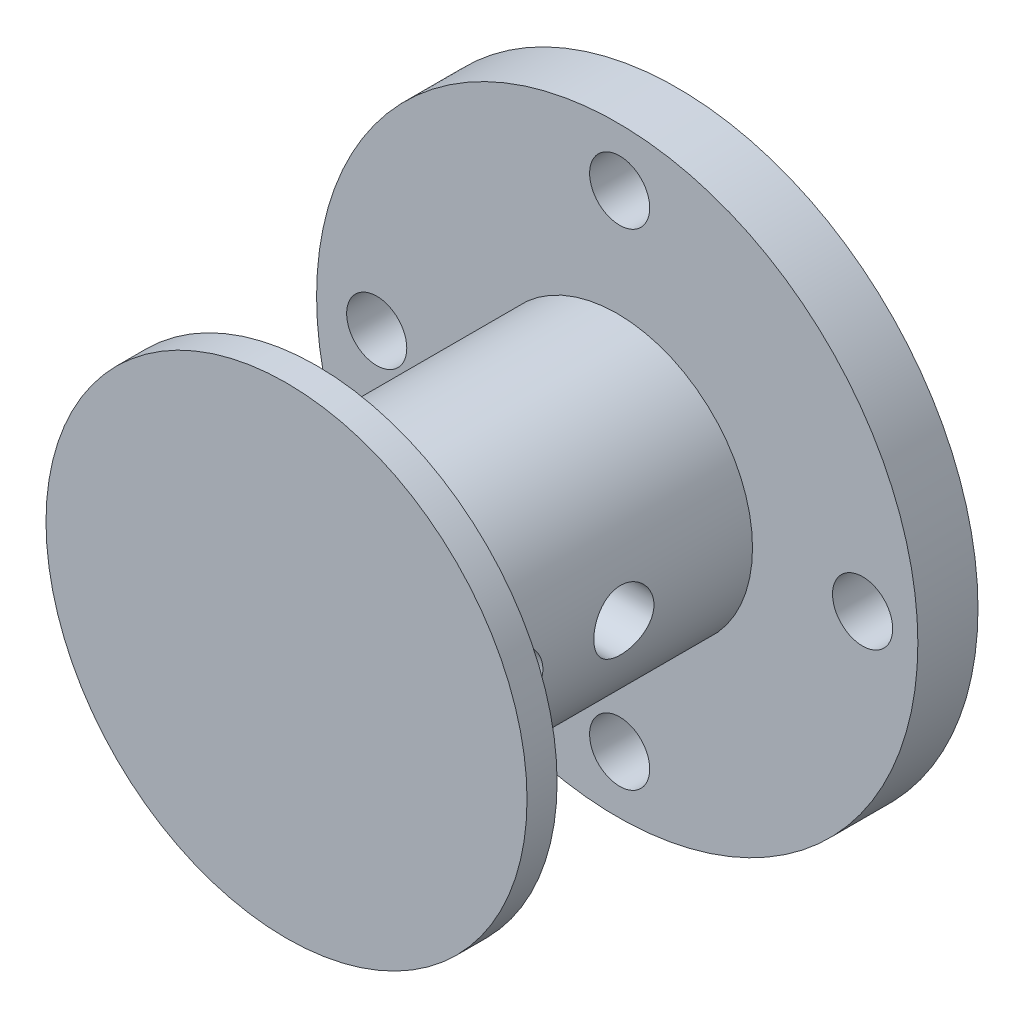
ISO-10303-21;
HEADER;
FILE_DESCRIPTION(('STEP AP214'),'2;1');
FILE_NAME('part.step','',(''),(''),'','','');
FILE_SCHEMA(('AUTOMOTIVE_DESIGN { 1 0 10303 214 1 1 1 1 }'));
ENDSEC;
DATA;
#1=APPLICATION_CONTEXT('core data for automotive mechanical design processes');
#2=APPLICATION_PROTOCOL_DEFINITION('international standard','automotive_design',2000,#1);
#3=PRODUCT_CONTEXT('',#1,'mechanical');
#4=PRODUCT('Part','Part','',(#3));
#5=PRODUCT_RELATED_PRODUCT_CATEGORY('part','',(#4));
#6=PRODUCT_DEFINITION_FORMATION('','',#4);
#7=PRODUCT_DEFINITION_CONTEXT('part definition',#1,'design');
#8=PRODUCT_DEFINITION('design','',#6,#7);
#9=PRODUCT_DEFINITION_SHAPE('','',#8);
#10=(LENGTH_UNIT() NAMED_UNIT(*) SI_UNIT(.MILLI.,.METRE.));
#11=(NAMED_UNIT(*) PLANE_ANGLE_UNIT() SI_UNIT($,.RADIAN.));
#12=(NAMED_UNIT(*) SI_UNIT($,.STERADIAN.) SOLID_ANGLE_UNIT());
#13=UNCERTAINTY_MEASURE_WITH_UNIT(LENGTH_MEASURE(1.E-05),#10,'distance_accuracy_value','');
#14=(GEOMETRIC_REPRESENTATION_CONTEXT(3) GLOBAL_UNCERTAINTY_ASSIGNED_CONTEXT((#13)) GLOBAL_UNIT_ASSIGNED_CONTEXT((#10,
#11,#12)) REPRESENTATION_CONTEXT('',''));
#15=CARTESIAN_POINT('',(0.,0.,0.));
#16=DIRECTION('',(0.,0.,1.));
#17=DIRECTION('',(1.,0.,0.));
#18=AXIS2_PLACEMENT_3D('',#15,#16,#17);
#19=CARTESIAN_POINT('',(0.,0.,12.));
#20=DIRECTION('',(0.,0.,-1.));
#21=DIRECTION('',(-1.,0.,0.));
#22=AXIS2_PLACEMENT_3D('',#19,#20,#21);
#23=CYLINDRICAL_SURFACE('',#22,4.5);
#24=CARTESIAN_POINT('',(0.,0.,12.));
#25=DIRECTION('',(0.,0.,1.));
#26=DIRECTION('',(1.,0.,0.));
#27=AXIS2_PLACEMENT_3D('',#24,#25,#26);
#28=CIRCLE('',#27,4.5);
#29=CARTESIAN_POINT('',(4.5,0.,12.));
#30=VERTEX_POINT('',#29);
#31=EDGE_CURVE('E116',#30,#30,#28,.T.);
#32=ORIENTED_EDGE('',*,*,#31,.F.);
#33=EDGE_LOOP('',(#32));
#34=FACE_BOUND('',#33,.T.);
#35=CARTESIAN_POINT('',(0.,0.,2.));
#36=DIRECTION('',(0.,0.,1.));
#37=DIRECTION('',(1.,0.,0.));
#38=AXIS2_PLACEMENT_3D('',#35,#36,#37);
#39=CIRCLE('',#38,4.5);
#40=CARTESIAN_POINT('',(4.5,0.,2.));
#41=VERTEX_POINT('',#40);
#42=EDGE_CURVE('E120',#41,#41,#39,.T.);
#43=ORIENTED_EDGE('',*,*,#42,.T.);
#44=EDGE_LOOP('',(#43));
#45=FACE_BOUND('',#44,.T.);
#46=CARTESIAN_POINT('',(4.5,0.,7.27837997559944));
#47=CARTESIAN_POINT('',(4.49999898109126,-0.0554402383878241,7.27837811375952));
#48=CARTESIAN_POINT('',(4.49896506997846,-0.11090278263481,7.27375398476769));
#49=CARTESIAN_POINT('',(4.49494048878835,-0.220250972051567,7.25539973942416));
#50=CARTESIAN_POINT('',(4.49194845108674,-0.274135487569494,7.24166325859479));
#51=CARTESIAN_POINT('',(4.48434056584504,-0.378731638880764,7.20553699035361));
#52=CARTESIAN_POINT('',(4.47972644219541,-0.429446576050142,7.1831563871005));
#53=CARTESIAN_POINT('',(4.46937167720689,-0.52640009015688,7.13040666936323));
#54=CARTESIAN_POINT('',(4.46363105773679,-0.572638753966673,7.10003770995413));
#55=CARTESIAN_POINT('',(4.45154547087105,-0.660093157007017,7.0316421430461));
#56=CARTESIAN_POINT('',(4.44519280820714,-0.701224306021767,6.99350872453186));
#57=CARTESIAN_POINT('',(4.43265300539893,-0.776562455229185,6.91089594555286));
#58=CARTESIAN_POINT('',(4.42646588044024,-0.810768822054276,6.86641600524421));
#59=CARTESIAN_POINT('',(4.41488164130856,-0.871662217051752,6.77174405357029));
#60=CARTESIAN_POINT('',(4.40949437871491,-0.898258710522017,6.72149249657867));
#61=CARTESIAN_POINT('',(4.40023048176198,-0.94259649477254,6.61709359475322));
#62=CARTESIAN_POINT('',(4.39635366052386,-0.96033888110048,6.56294673284731));
#63=CARTESIAN_POINT('',(4.39062804729594,-0.986184290032021,6.4532132369381));
#64=CARTESIAN_POINT('',(4.38874772903892,-0.994437335190343,6.39766361804672));
#65=CARTESIAN_POINT('',(4.38713336865335,-1.00153635498836,6.28593886670633));
#66=CARTESIAN_POINT('',(4.38739905389469,-1.00038352455831,6.22976381461836));
#67=CARTESIAN_POINT('',(4.39001816074073,-0.988824137586509,6.11950166200253));
#68=CARTESIAN_POINT('',(4.3923321569242,-0.978592322301085,6.06539516352976));
#69=CARTESIAN_POINT('',(4.39872477095838,-0.94944245340573,5.95968640393693));
#70=CARTESIAN_POINT('',(4.40280349066588,-0.930523898408257,5.90808428755674));
#71=CARTESIAN_POINT('',(4.41230454985148,-0.884378364364373,5.80836025640849));
#72=CARTESIAN_POINT('',(4.41773762181245,-0.857084596896763,5.7602703119314));
#73=CARTESIAN_POINT('',(4.42932868955372,-0.795010340699248,5.66928854034149));
#74=CARTESIAN_POINT('',(4.43548678710298,-0.760228800371371,5.62639744468936));
#75=CARTESIAN_POINT('',(4.44800287306333,-0.683243418514913,5.5460253209252));
#76=CARTESIAN_POINT('',(4.45436225343936,-0.640891102633116,5.50868658304691));
#77=CARTESIAN_POINT('',(4.46643919561158,-0.55045330904581,5.44161811114588));
#78=CARTESIAN_POINT('',(4.47215674504213,-0.502367720918685,5.41188852370849));
#79=CARTESIAN_POINT('',(4.48232532116804,-0.401651595367367,5.36084533771103));
#80=CARTESIAN_POINT('',(4.4867734650383,-0.349011061159927,5.33955085344531));
#81=CARTESIAN_POINT('',(4.49388068183127,-0.240777965490728,5.3061494690705));
#82=CARTESIAN_POINT('',(4.49654002348392,-0.185185848796682,5.29404118889237));
#83=CARTESIAN_POINT('',(4.49973158880836,-0.0738477416404218,5.27956396897185));
#84=CARTESIAN_POINT('',(4.50030624311145,-0.018128198659452,5.27700072551859));
#85=CARTESIAN_POINT('',(4.49938279325299,0.0929429619640402,5.28115902772962));
#86=CARTESIAN_POINT('',(4.4978848344523,0.148294605135323,5.28787992225916));
#87=CARTESIAN_POINT('',(4.49301129379307,0.256411628664711,5.31025468318349));
#88=CARTESIAN_POINT('',(4.4896572350388,0.309199245857742,5.32580620371116));
#89=CARTESIAN_POINT('',(4.48144710543397,0.411416402927916,5.36528681932197));
#90=CARTESIAN_POINT('',(4.4765909038233,0.460845650005089,5.38921664375244));
#91=CARTESIAN_POINT('',(4.4658107661382,0.555743219947189,5.44517641399893));
#92=CARTESIAN_POINT('',(4.45987222295123,0.601142865416123,5.47731994710252));
#93=CARTESIAN_POINT('',(4.4476151617454,0.68597348249406,5.54864560015015));
#94=CARTESIAN_POINT('',(4.44129659275087,0.725403650867063,5.58782866576549));
#95=CARTESIAN_POINT('',(4.42884439472905,0.797947740954927,5.67301399238979));
#96=CARTESIAN_POINT('',(4.42271658832142,0.830926909700366,5.71913202060273));
#97=CARTESIAN_POINT('',(4.41147697689154,0.88867305961376,5.81636599280484));
#98=CARTESIAN_POINT('',(4.40636512747635,0.913440399634868,5.86748171827048));
#99=CARTESIAN_POINT('',(4.39778600274463,0.953890009481296,5.972984120152));
#100=CARTESIAN_POINT('',(4.39430939829893,0.969623931773795,6.02735019673386));
#101=CARTESIAN_POINT('',(4.38937824848696,0.991710138292029,6.13804206803067));
#102=CARTESIAN_POINT('',(4.38792336773666,0.998063978591781,6.19436753611241));
#103=CARTESIAN_POINT('',(4.38722200724489,1.00114178320522,6.3060194147386));
#104=CARTESIAN_POINT('',(4.38792649185062,0.998079565719667,6.36133972962947));
#105=CARTESIAN_POINT('',(4.39135332478774,0.982891385608439,6.47065483058285));
#106=CARTESIAN_POINT('',(4.39407564773517,0.970765537001197,6.52464963331118));
#107=CARTESIAN_POINT('',(4.40120714065762,0.937899099903721,6.62960453571313));
#108=CARTESIAN_POINT('',(4.40561002591385,0.917190583142267,6.68057513404023));
#109=CARTESIAN_POINT('',(4.41560882234529,0.86777385174171,6.7783499718728));
#110=CARTESIAN_POINT('',(4.42120486238316,0.839064772925967,6.82515376058144));
#111=CARTESIAN_POINT('',(4.43310521417665,0.773756794952789,6.91431828007342));
#112=CARTESIAN_POINT('',(4.4394218568387,0.737005927555191,6.95656607806076));
#113=CARTESIAN_POINT('',(4.45196987086694,0.65696435297252,7.0343650125651));
#114=CARTESIAN_POINT('',(4.45820122214526,0.613672133116717,7.06991459585364));
#115=CARTESIAN_POINT('',(4.46997629863291,0.521072985322783,7.13376796705939));
#116=CARTESIAN_POINT('',(4.47550961749614,0.471692818317474,7.1619675754669));
#117=CARTESIAN_POINT('',(4.48516029184624,0.368780139889408,7.20962162769004));
#118=CARTESIAN_POINT('',(4.48927881635408,0.315251101656497,7.22908329562252));
#119=CARTESIAN_POINT('',(4.49491406454777,0.218069123864704,7.25530065073783));
#120=CARTESIAN_POINT('',(4.49680934511605,0.17493599595084,7.26393866243258));
#121=CARTESIAN_POINT('',(4.49935268729894,0.0878732249472634,7.27547892775251));
#122=CARTESIAN_POINT('',(4.50000080761806,0.0439436194464388,7.27838145135039));
#123=CARTESIAN_POINT('',(4.5,0.,7.27837997559944));
#124=B_SPLINE_CURVE_WITH_KNOTS('',3,(#46,#47,#48,#49,#50,#51,#52,#53,#54,#55,#56,#57,#58,#59,
#60,#61,#62,#63,#64,#65,#66,#67,#68,#69,#70,#71,#72,#73,#74,#75,#76,#77,#78,#79,#80,#81,#82,#83,
#84,#85,#86,#87,#88,#89,#90,#91,#92,#93,#94,#95,#96,#97,#98,#99,#100,#101,#102,#103,#104,#105,
#106,#107,#108,#109,#110,#111,#112,#113,#114,#115,#116,#117,#118,#119,#120,#121,#122,#123),
.UNSPECIFIED.,.T.,.F.,(4,2,2,2,2,2,2,2,2,2,2,2,2,2,2,2,2,2,2,2,2,2,2,2,2,2,2,2,2,2,2,2,2,2,2,2,
2,2,4),(0.,0.166159844864898,0.332435865624642,0.498535706203729,0.664632322584945,
0.833190360010395,1.00176380745257,1.17226648148988,1.3427480534387,1.51049562819053,
1.67822189248295,1.84278834072892,2.0073642887347,2.17328834854791,2.3392357262915,
2.50889089904488,2.67854933984914,2.84859006405619,3.01860523750994,3.18513996062134,
3.35166300456134,3.51629434712583,3.68094002472729,3.84799901631021,4.01508046693878,
4.18534736552864,4.35560682255205,4.52488279527622,4.69413068343205,4.85956392571208,
5.02499508691429,5.18981356007889,5.35464984293193,5.52292163156412,5.69123239233205,
5.86181293524784,6.03225218935467,6.16396173679278,6.29566508443975),.UNSPECIFIED.);
#125=CARTESIAN_POINT('',(4.5,0.,7.27837997559944));
#126=VERTEX_POINT('',#125);
#127=EDGE_CURVE('E65',#126,#126,#124,.T.);
#128=ORIENTED_EDGE('',*,*,#127,.F.);
#129=EDGE_LOOP('',(#128));
#130=FACE_BOUND('',#129,.T.);
#131=CARTESIAN_POINT('',(-4.5,0.,7.27837997559944));
#132=CARTESIAN_POINT('',(-4.49999898109126,0.0554402383878241,7.27837811375952));
#133=CARTESIAN_POINT('',(-4.49896506997846,0.11090278263481,7.27375398476769));
#134=CARTESIAN_POINT('',(-4.49494048878835,0.220250972051567,7.25539973942416));
#135=CARTESIAN_POINT('',(-4.49194845108674,0.274135487569494,7.24166325859479));
#136=CARTESIAN_POINT('',(-4.48434056584504,0.378731638880764,7.20553699035361));
#137=CARTESIAN_POINT('',(-4.47972644219541,0.429446576050142,7.1831563871005));
#138=CARTESIAN_POINT('',(-4.46937167720689,0.52640009015688,7.13040666936323));
#139=CARTESIAN_POINT('',(-4.46363105773679,0.572638753966673,7.10003770995413));
#140=CARTESIAN_POINT('',(-4.45154547087105,0.660093157007017,7.0316421430461));
#141=CARTESIAN_POINT('',(-4.44519280820714,0.701224306021767,6.99350872453186));
#142=CARTESIAN_POINT('',(-4.43265300539893,0.776562455229185,6.91089594555286));
#143=CARTESIAN_POINT('',(-4.42646588044024,0.810768822054276,6.86641600524421));
#144=CARTESIAN_POINT('',(-4.41488164130856,0.871662217051752,6.77174405357029));
#145=CARTESIAN_POINT('',(-4.40949437871491,0.898258710522017,6.72149249657867));
#146=CARTESIAN_POINT('',(-4.40023048176198,0.94259649477254,6.61709359475322));
#147=CARTESIAN_POINT('',(-4.39635366052386,0.96033888110048,6.56294673284731));
#148=CARTESIAN_POINT('',(-4.39062804729594,0.986184290032021,6.4532132369381));
#149=CARTESIAN_POINT('',(-4.38874772903892,0.994437335190343,6.39766361804672));
#150=CARTESIAN_POINT('',(-4.38713336865335,1.00153635498836,6.28593886670633));
#151=CARTESIAN_POINT('',(-4.38739905389469,1.00038352455831,6.22976381461836));
#152=CARTESIAN_POINT('',(-4.39001816074073,0.988824137586509,6.11950166200253));
#153=CARTESIAN_POINT('',(-4.3923321569242,0.978592322301085,6.06539516352976));
#154=CARTESIAN_POINT('',(-4.39872477095838,0.94944245340573,5.95968640393693));
#155=CARTESIAN_POINT('',(-4.40280349066588,0.930523898408257,5.90808428755674));
#156=CARTESIAN_POINT('',(-4.41230454985148,0.884378364364373,5.80836025640849));
#157=CARTESIAN_POINT('',(-4.41773762181245,0.857084596896763,5.7602703119314));
#158=CARTESIAN_POINT('',(-4.42932868955372,0.795010340699248,5.66928854034149));
#159=CARTESIAN_POINT('',(-4.43548678710298,0.760228800371371,5.62639744468936));
#160=CARTESIAN_POINT('',(-4.44800287306333,0.683243418514913,5.5460253209252));
#161=CARTESIAN_POINT('',(-4.45436225343936,0.640891102633116,5.50868658304691));
#162=CARTESIAN_POINT('',(-4.46643919561158,0.55045330904581,5.44161811114588));
#163=CARTESIAN_POINT('',(-4.47215674504213,0.502367720918685,5.41188852370849));
#164=CARTESIAN_POINT('',(-4.48232532116804,0.401651595367367,5.36084533771103));
#165=CARTESIAN_POINT('',(-4.4867734650383,0.349011061159927,5.33955085344531));
#166=CARTESIAN_POINT('',(-4.49388068183127,0.240777965490728,5.3061494690705));
#167=CARTESIAN_POINT('',(-4.49654002348392,0.185185848796682,5.29404118889237));
#168=CARTESIAN_POINT('',(-4.49973158880836,0.0738477416404218,5.27956396897185));
#169=CARTESIAN_POINT('',(-4.50030624311145,0.018128198659452,5.27700072551859));
#170=CARTESIAN_POINT('',(-4.49938279325299,-0.0929429619640402,5.28115902772962));
#171=CARTESIAN_POINT('',(-4.4978848344523,-0.148294605135323,5.28787992225916));
#172=CARTESIAN_POINT('',(-4.49301129379307,-0.256411628664711,5.31025468318349));
#173=CARTESIAN_POINT('',(-4.4896572350388,-0.309199245857742,5.32580620371116));
#174=CARTESIAN_POINT('',(-4.48144710543397,-0.411416402927916,5.36528681932197));
#175=CARTESIAN_POINT('',(-4.4765909038233,-0.460845650005089,5.38921664375244));
#176=CARTESIAN_POINT('',(-4.4658107661382,-0.555743219947189,5.44517641399893));
#177=CARTESIAN_POINT('',(-4.45987222295123,-0.601142865416123,5.47731994710252));
#178=CARTESIAN_POINT('',(-4.4476151617454,-0.68597348249406,5.54864560015015));
#179=CARTESIAN_POINT('',(-4.44129659275087,-0.725403650867063,5.58782866576549));
#180=CARTESIAN_POINT('',(-4.42884439472905,-0.797947740954927,5.67301399238979));
#181=CARTESIAN_POINT('',(-4.42271658832142,-0.830926909700366,5.71913202060273));
#182=CARTESIAN_POINT('',(-4.41147697689154,-0.88867305961376,5.81636599280484));
#183=CARTESIAN_POINT('',(-4.40636512747635,-0.913440399634868,5.86748171827048));
#184=CARTESIAN_POINT('',(-4.39778600274463,-0.953890009481296,5.972984120152));
#185=CARTESIAN_POINT('',(-4.39430939829893,-0.969623931773795,6.02735019673386));
#186=CARTESIAN_POINT('',(-4.38937824848696,-0.991710138292029,6.13804206803067));
#187=CARTESIAN_POINT('',(-4.38792336773666,-0.998063978591781,6.19436753611241));
#188=CARTESIAN_POINT('',(-4.38722200724489,-1.00114178320522,6.3060194147386));
#189=CARTESIAN_POINT('',(-4.38792649185062,-0.998079565719667,6.36133972962947));
#190=CARTESIAN_POINT('',(-4.39135332478774,-0.982891385608439,6.47065483058285));
#191=CARTESIAN_POINT('',(-4.39407564773517,-0.970765537001197,6.52464963331118));
#192=CARTESIAN_POINT('',(-4.40120714065762,-0.937899099903721,6.62960453571313));
#193=CARTESIAN_POINT('',(-4.40561002591385,-0.917190583142267,6.68057513404023));
#194=CARTESIAN_POINT('',(-4.41560882234529,-0.86777385174171,6.7783499718728));
#195=CARTESIAN_POINT('',(-4.42120486238316,-0.839064772925967,6.82515376058144));
#196=CARTESIAN_POINT('',(-4.43310521417665,-0.773756794952789,6.91431828007342));
#197=CARTESIAN_POINT('',(-4.4394218568387,-0.737005927555191,6.95656607806076));
#198=CARTESIAN_POINT('',(-4.45196987086694,-0.65696435297252,7.0343650125651));
#199=CARTESIAN_POINT('',(-4.45820122214526,-0.613672133116717,7.06991459585364));
#200=CARTESIAN_POINT('',(-4.46997629863291,-0.521072985322783,7.13376796705939));
#201=CARTESIAN_POINT('',(-4.47550961749614,-0.471692818317474,7.1619675754669));
#202=CARTESIAN_POINT('',(-4.48516029184624,-0.368780139889408,7.20962162769004));
#203=CARTESIAN_POINT('',(-4.48927881635408,-0.315251101656497,7.22908329562252));
#204=CARTESIAN_POINT('',(-4.49491406454777,-0.218069123864704,7.25530065073783));
#205=CARTESIAN_POINT('',(-4.49680934511605,-0.17493599595084,7.26393866243258));
#206=CARTESIAN_POINT('',(-4.49935268729894,-0.0878732249472634,7.27547892775251));
#207=CARTESIAN_POINT('',(-4.50000080761806,-0.0439436194464388,7.27838145135039));
#208=CARTESIAN_POINT('',(-4.5,0.,7.27837997559944));
#209=B_SPLINE_CURVE_WITH_KNOTS('',3,(#131,#132,#133,#134,#135,#136,#137,#138,#139,#140,#141,
#142,#143,#144,#145,#146,#147,#148,#149,#150,#151,#152,#153,#154,#155,#156,#157,#158,#159,#160,
#161,#162,#163,#164,#165,#166,#167,#168,#169,#170,#171,#172,#173,#174,#175,#176,#177,#178,#179,
#180,#181,#182,#183,#184,#185,#186,#187,#188,#189,#190,#191,#192,#193,#194,#195,#196,#197,#198,
#199,#200,#201,#202,#203,#204,#205,#206,#207,#208),.UNSPECIFIED.,.T.,.F.,(4,2,2,2,2,2,2,2,2,2,2,
2,2,2,2,2,2,2,2,2,2,2,2,2,2,2,2,2,2,2,2,2,2,2,2,2,2,2,4),(0.,0.166159844864898,
0.332435865624642,0.498535706203729,0.664632322584945,0.833190360010395,1.00176380745257,
1.17226648148988,1.3427480534387,1.51049562819053,1.67822189248295,1.84278834072892,
2.0073642887347,2.17328834854791,2.3392357262915,2.50889089904488,2.67854933984914,
2.84859006405619,3.01860523750994,3.18513996062134,3.35166300456134,3.51629434712583,
3.68094002472729,3.84799901631021,4.01508046693878,4.18534736552864,4.35560682255205,
4.52488279527622,4.69413068343205,4.85956392571208,5.02499508691429,5.18981356007889,
5.35464984293193,5.52292163156412,5.69123239233205,5.86181293524784,6.03225218935467,
6.16396173679278,6.29566508443975),.UNSPECIFIED.);
#210=CARTESIAN_POINT('',(-4.5,0.,7.27837997559944));
#211=VERTEX_POINT('',#210);
#212=EDGE_CURVE('E73',#211,#211,#209,.T.);
#213=ORIENTED_EDGE('',*,*,#212,.F.);
#214=EDGE_LOOP('',(#213));
#215=FACE_BOUND('',#214,.T.);
#216=CARTESIAN_POINT('',(4.5,0.,10.9724472509308));
#217=CARTESIAN_POINT('',(4.49999898109126,-0.0554402383878242,10.9724453890909));
#218=CARTESIAN_POINT('',(4.49896506997846,-0.11090278263481,10.9678212600991));
#219=CARTESIAN_POINT('',(4.49494048878835,-0.220250972051567,10.9494670147556));
#220=CARTESIAN_POINT('',(4.49194845108674,-0.274135487569494,10.9357305339262));
#221=CARTESIAN_POINT('',(4.48434056584504,-0.378731638880765,10.899604265685));
#222=CARTESIAN_POINT('',(4.47972644219541,-0.429446576050143,10.8772236624319));
#223=CARTESIAN_POINT('',(4.46937167720689,-0.526400090156881,10.8244739446946));
#224=CARTESIAN_POINT('',(4.46363105773679,-0.572638753966673,10.7941049852855));
#225=CARTESIAN_POINT('',(4.45154547087105,-0.660093157007017,10.7257094183775));
#226=CARTESIAN_POINT('',(4.44519280820714,-0.701224306021768,10.6875759998633));
#227=CARTESIAN_POINT('',(4.43265300539893,-0.776562455229186,10.6049632208843));
#228=CARTESIAN_POINT('',(4.42646588044024,-0.810768822054277,10.5604832805756));
#229=CARTESIAN_POINT('',(4.41488164130856,-0.871662217051754,10.4658113289017));
#230=CARTESIAN_POINT('',(4.40949437871491,-0.898258710522019,10.4155597719101));
#231=CARTESIAN_POINT('',(4.40023048176198,-0.942596494772542,10.3111608700846));
#232=CARTESIAN_POINT('',(4.39635366052386,-0.960338881100481,10.2570140081787));
#233=CARTESIAN_POINT('',(4.39062804729594,-0.986184290032023,10.1472805122695));
#234=CARTESIAN_POINT('',(4.38874772903891,-0.994437335190345,10.0917308933781));
#235=CARTESIAN_POINT('',(4.38713336865335,-1.00153635498837,9.98000614203773));
#236=CARTESIAN_POINT('',(4.38739905389469,-1.00038352455832,9.92383108994975));
#237=CARTESIAN_POINT('',(4.39001816074073,-0.98882413758651,9.81356893733392));
#238=CARTESIAN_POINT('',(4.3923321569242,-0.978592322301087,9.75946243886115));
#239=CARTESIAN_POINT('',(4.39872477095838,-0.949442453405732,9.65375367926833));
#240=CARTESIAN_POINT('',(4.40280349066588,-0.930523898408259,9.60215156288812));
#241=CARTESIAN_POINT('',(4.41230454985148,-0.884378364364374,9.50242753173988));
#242=CARTESIAN_POINT('',(4.41773762181245,-0.857084596896764,9.45433758726279));
#243=CARTESIAN_POINT('',(4.42932868955372,-0.795010340699249,9.36335581567288));
#244=CARTESIAN_POINT('',(4.43548678710298,-0.760228800371372,9.32046472002075));
#245=CARTESIAN_POINT('',(4.44800287306333,-0.683243418514914,9.24009259625659));
#246=CARTESIAN_POINT('',(4.45436225343936,-0.640891102633117,9.2027538583783));
#247=CARTESIAN_POINT('',(4.46643919561158,-0.55045330904581,9.13568538647727));
#248=CARTESIAN_POINT('',(4.47215674504213,-0.502367720918686,9.10595579903988));
#249=CARTESIAN_POINT('',(4.48232532116804,-0.401651595367368,9.05491261304242));
#250=CARTESIAN_POINT('',(4.4867734650383,-0.349011061159928,9.0336181287767));
#251=CARTESIAN_POINT('',(4.49388068183127,-0.240777965490729,9.00021674440189));
#252=CARTESIAN_POINT('',(4.49654002348392,-0.185185848796683,8.98810846422376));
#253=CARTESIAN_POINT('',(4.49973158880836,-0.0738477416404228,8.97363124430324));
#254=CARTESIAN_POINT('',(4.50030624311145,-0.0181281986594528,8.97106800084998));
#255=CARTESIAN_POINT('',(4.49938279325299,0.0929429619640398,8.97522630306101));
#256=CARTESIAN_POINT('',(4.4978848344523,0.148294605135323,8.98194719759055));
#257=CARTESIAN_POINT('',(4.49301129379307,0.256411628664711,9.00432195851488));
#258=CARTESIAN_POINT('',(4.4896572350388,0.309199245857742,9.01987347904255));
#259=CARTESIAN_POINT('',(4.48144710543397,0.411416402927916,9.05935409465336));
#260=CARTESIAN_POINT('',(4.4765909038233,0.460845650005089,9.08328391908383));
#261=CARTESIAN_POINT('',(4.4658107661382,0.55574321994719,9.13924368933032));
#262=CARTESIAN_POINT('',(4.45987222295124,0.601142865416123,9.17138722243391));
#263=CARTESIAN_POINT('',(4.4476151617454,0.68597348249406,9.24271287548154));
#264=CARTESIAN_POINT('',(4.44129659275087,0.725403650867063,9.28189594109687));
#265=CARTESIAN_POINT('',(4.42884439472905,0.797947740954928,9.36708126772117));
#266=CARTESIAN_POINT('',(4.42271658832142,0.830926909700367,9.41319929593413));
#267=CARTESIAN_POINT('',(4.41147697689154,0.888673059613761,9.51043326813623));
#268=CARTESIAN_POINT('',(4.40636512747635,0.913440399634869,9.56154899360187));
#269=CARTESIAN_POINT('',(4.39778600274463,0.953890009481297,9.66705139548339));
#270=CARTESIAN_POINT('',(4.39430939829893,0.969623931773796,9.72141747206524));
#271=CARTESIAN_POINT('',(4.38937824848696,0.99171013829203,9.83210934336206));
#272=CARTESIAN_POINT('',(4.38792336773666,0.998063978591782,9.8884348114438));
#273=CARTESIAN_POINT('',(4.38722200724489,1.00114178320522,10.00008669007));
#274=CARTESIAN_POINT('',(4.38792649185062,0.998079565719669,10.0554070049609));
#275=CARTESIAN_POINT('',(4.39135332478774,0.98289138560844,10.1647221059142));
#276=CARTESIAN_POINT('',(4.39407564773517,0.970765537001199,10.2187169086426));
#277=CARTESIAN_POINT('',(4.40120714065762,0.937899099903723,10.3236718110445));
#278=CARTESIAN_POINT('',(4.40561002591385,0.917190583142269,10.3746424093716));
#279=CARTESIAN_POINT('',(4.41560882234529,0.867773851741712,10.4724172472042));
#280=CARTESIAN_POINT('',(4.42120486238316,0.839064772925969,10.5192210359128));
#281=CARTESIAN_POINT('',(4.43310521417665,0.773756794952791,10.6083855554048));
#282=CARTESIAN_POINT('',(4.4394218568387,0.737005927555193,10.6506333533922));
#283=CARTESIAN_POINT('',(4.45196987086694,0.656964352972521,10.7284322878965));
#284=CARTESIAN_POINT('',(4.45820122214526,0.613672133116718,10.763981871185));
#285=CARTESIAN_POINT('',(4.46997629863291,0.521072985322783,10.8278352423908));
#286=CARTESIAN_POINT('',(4.47550961749614,0.471692818317475,10.8560348507983));
#287=CARTESIAN_POINT('',(4.48516029184624,0.368780139889409,10.9036889030214));
#288=CARTESIAN_POINT('',(4.48927881635408,0.315251101656498,10.9231505709539));
#289=CARTESIAN_POINT('',(4.49491406454777,0.218069123864705,10.9493679260692));
#290=CARTESIAN_POINT('',(4.49680934511605,0.174935995950841,10.958005937764));
#291=CARTESIAN_POINT('',(4.49935268729894,0.0878732249472641,10.9695462030839));
#292=CARTESIAN_POINT('',(4.50000080761806,0.0439436194464391,10.9724487266818));
#293=CARTESIAN_POINT('',(4.5,0.,10.9724472509308));
#294=B_SPLINE_CURVE_WITH_KNOTS('',3,(#216,#217,#218,#219,#220,#221,#222,#223,#224,#225,#226,
#227,#228,#229,#230,#231,#232,#233,#234,#235,#236,#237,#238,#239,#240,#241,#242,#243,#244,#245,
#246,#247,#248,#249,#250,#251,#252,#253,#254,#255,#256,#257,#258,#259,#260,#261,#262,#263,#264,
#265,#266,#267,#268,#269,#270,#271,#272,#273,#274,#275,#276,#277,#278,#279,#280,#281,#282,#283,
#284,#285,#286,#287,#288,#289,#290,#291,#292,#293),.UNSPECIFIED.,.T.,.F.,(4,2,2,2,2,2,2,2,2,2,2,
2,2,2,2,2,2,2,2,2,2,2,2,2,2,2,2,2,2,2,2,2,2,2,2,2,2,2,4),(0.,0.166159844864899,
0.332435865624642,0.49853570620373,0.664632322584946,0.833190360010395,1.00176380745257,
1.17226648148988,1.3427480534387,1.51049562819054,1.67822189248296,1.84278834072892,
2.0073642887347,2.17328834854791,2.3392357262915,2.50889089904489,2.67854933984914,
2.84859006405619,3.01860523750994,3.18513996062135,3.35166300456134,3.51629434712584,
3.6809400247273,3.84799901631021,4.01508046693879,4.18534736552865,4.35560682255206,
4.52488279527622,4.69413068343206,4.85956392571209,5.0249950869143,5.1898135600789,
5.35464984293194,5.52292163156413,5.69123239233206,5.86181293524785,6.03225218935468,
6.16396173679279,6.29566508443976),.UNSPECIFIED.);
#295=CARTESIAN_POINT('',(4.5,0.,10.9724472509308));
#296=VERTEX_POINT('',#295);
#297=EDGE_CURVE('E129',#296,#296,#294,.T.);
#298=ORIENTED_EDGE('',*,*,#297,.F.);
#299=EDGE_LOOP('',(#298));
#300=FACE_BOUND('',#299,.T.);
#301=CARTESIAN_POINT('',(-4.5,0.,10.9724472509308));
#302=CARTESIAN_POINT('',(-4.49999898109126,0.0554402383878242,10.9724453890909));
#303=CARTESIAN_POINT('',(-4.49896506997846,0.11090278263481,10.9678212600991));
#304=CARTESIAN_POINT('',(-4.49494048878835,0.220250972051567,10.9494670147556));
#305=CARTESIAN_POINT('',(-4.49194845108674,0.274135487569494,10.9357305339262));
#306=CARTESIAN_POINT('',(-4.48434056584504,0.378731638880765,10.899604265685));
#307=CARTESIAN_POINT('',(-4.47972644219541,0.429446576050143,10.8772236624319));
#308=CARTESIAN_POINT('',(-4.46937167720689,0.526400090156881,10.8244739446946));
#309=CARTESIAN_POINT('',(-4.46363105773679,0.572638753966673,10.7941049852855));
#310=CARTESIAN_POINT('',(-4.45154547087105,0.660093157007017,10.7257094183775));
#311=CARTESIAN_POINT('',(-4.44519280820714,0.701224306021768,10.6875759998633));
#312=CARTESIAN_POINT('',(-4.43265300539893,0.776562455229186,10.6049632208843));
#313=CARTESIAN_POINT('',(-4.42646588044024,0.810768822054277,10.5604832805756));
#314=CARTESIAN_POINT('',(-4.41488164130856,0.871662217051754,10.4658113289017));
#315=CARTESIAN_POINT('',(-4.40949437871491,0.898258710522019,10.4155597719101));
#316=CARTESIAN_POINT('',(-4.40023048176198,0.942596494772542,10.3111608700846));
#317=CARTESIAN_POINT('',(-4.39635366052386,0.960338881100481,10.2570140081787));
#318=CARTESIAN_POINT('',(-4.39062804729594,0.986184290032023,10.1472805122695));
#319=CARTESIAN_POINT('',(-4.38874772903891,0.994437335190345,10.0917308933781));
#320=CARTESIAN_POINT('',(-4.38713336865335,1.00153635498837,9.98000614203773));
#321=CARTESIAN_POINT('',(-4.38739905389469,1.00038352455832,9.92383108994975));
#322=CARTESIAN_POINT('',(-4.39001816074073,0.98882413758651,9.81356893733392));
#323=CARTESIAN_POINT('',(-4.3923321569242,0.978592322301087,9.75946243886115));
#324=CARTESIAN_POINT('',(-4.39872477095838,0.949442453405732,9.65375367926833));
#325=CARTESIAN_POINT('',(-4.40280349066588,0.930523898408259,9.60215156288812));
#326=CARTESIAN_POINT('',(-4.41230454985148,0.884378364364374,9.50242753173988));
#327=CARTESIAN_POINT('',(-4.41773762181245,0.857084596896764,9.45433758726279));
#328=CARTESIAN_POINT('',(-4.42932868955372,0.795010340699249,9.36335581567288));
#329=CARTESIAN_POINT('',(-4.43548678710298,0.760228800371372,9.32046472002075));
#330=CARTESIAN_POINT('',(-4.44800287306333,0.683243418514914,9.24009259625659));
#331=CARTESIAN_POINT('',(-4.45436225343936,0.640891102633117,9.2027538583783));
#332=CARTESIAN_POINT('',(-4.46643919561158,0.55045330904581,9.13568538647727));
#333=CARTESIAN_POINT('',(-4.47215674504213,0.502367720918686,9.10595579903988));
#334=CARTESIAN_POINT('',(-4.48232532116804,0.401651595367368,9.05491261304242));
#335=CARTESIAN_POINT('',(-4.4867734650383,0.349011061159928,9.0336181287767));
#336=CARTESIAN_POINT('',(-4.49388068183127,0.240777965490729,9.00021674440189));
#337=CARTESIAN_POINT('',(-4.49654002348392,0.185185848796683,8.98810846422376));
#338=CARTESIAN_POINT('',(-4.49973158880836,0.0738477416404228,8.97363124430324));
#339=CARTESIAN_POINT('',(-4.50030624311145,0.0181281986594528,8.97106800084998));
#340=CARTESIAN_POINT('',(-4.49938279325299,-0.0929429619640398,8.97522630306101));
#341=CARTESIAN_POINT('',(-4.4978848344523,-0.148294605135323,8.98194719759055));
#342=CARTESIAN_POINT('',(-4.49301129379307,-0.256411628664711,9.00432195851488));
#343=CARTESIAN_POINT('',(-4.4896572350388,-0.309199245857742,9.01987347904255));
#344=CARTESIAN_POINT('',(-4.48144710543397,-0.411416402927916,9.05935409465336));
#345=CARTESIAN_POINT('',(-4.4765909038233,-0.460845650005089,9.08328391908383));
#346=CARTESIAN_POINT('',(-4.4658107661382,-0.55574321994719,9.13924368933032));
#347=CARTESIAN_POINT('',(-4.45987222295124,-0.601142865416123,9.17138722243391));
#348=CARTESIAN_POINT('',(-4.4476151617454,-0.68597348249406,9.24271287548154));
#349=CARTESIAN_POINT('',(-4.44129659275087,-0.725403650867063,9.28189594109687));
#350=CARTESIAN_POINT('',(-4.42884439472905,-0.797947740954928,9.36708126772117));
#351=CARTESIAN_POINT('',(-4.42271658832142,-0.830926909700367,9.41319929593413));
#352=CARTESIAN_POINT('',(-4.41147697689154,-0.888673059613761,9.51043326813623));
#353=CARTESIAN_POINT('',(-4.40636512747635,-0.913440399634869,9.56154899360187));
#354=CARTESIAN_POINT('',(-4.39778600274463,-0.953890009481297,9.66705139548339));
#355=CARTESIAN_POINT('',(-4.39430939829893,-0.969623931773796,9.72141747206524));
#356=CARTESIAN_POINT('',(-4.38937824848696,-0.99171013829203,9.83210934336206));
#357=CARTESIAN_POINT('',(-4.38792336773666,-0.998063978591782,9.8884348114438));
#358=CARTESIAN_POINT('',(-4.38722200724489,-1.00114178320522,10.00008669007));
#359=CARTESIAN_POINT('',(-4.38792649185062,-0.998079565719669,10.0554070049609));
#360=CARTESIAN_POINT('',(-4.39135332478774,-0.98289138560844,10.1647221059142));
#361=CARTESIAN_POINT('',(-4.39407564773517,-0.970765537001199,10.2187169086426));
#362=CARTESIAN_POINT('',(-4.40120714065762,-0.937899099903723,10.3236718110445));
#363=CARTESIAN_POINT('',(-4.40561002591385,-0.917190583142269,10.3746424093716));
#364=CARTESIAN_POINT('',(-4.41560882234529,-0.867773851741712,10.4724172472042));
#365=CARTESIAN_POINT('',(-4.42120486238316,-0.839064772925969,10.5192210359128));
#366=CARTESIAN_POINT('',(-4.43310521417665,-0.773756794952791,10.6083855554048));
#367=CARTESIAN_POINT('',(-4.4394218568387,-0.737005927555193,10.6506333533922));
#368=CARTESIAN_POINT('',(-4.45196987086694,-0.656964352972521,10.7284322878965));
#369=CARTESIAN_POINT('',(-4.45820122214526,-0.613672133116718,10.763981871185));
#370=CARTESIAN_POINT('',(-4.46997629863291,-0.521072985322783,10.8278352423908));
#371=CARTESIAN_POINT('',(-4.47550961749614,-0.471692818317475,10.8560348507983));
#372=CARTESIAN_POINT('',(-4.48516029184624,-0.368780139889409,10.9036889030214));
#373=CARTESIAN_POINT('',(-4.48927881635408,-0.315251101656498,10.9231505709539));
#374=CARTESIAN_POINT('',(-4.49491406454777,-0.218069123864705,10.9493679260692));
#375=CARTESIAN_POINT('',(-4.49680934511605,-0.174935995950841,10.958005937764));
#376=CARTESIAN_POINT('',(-4.49935268729894,-0.0878732249472641,10.9695462030839));
#377=CARTESIAN_POINT('',(-4.50000080761806,-0.0439436194464391,10.9724487266818));
#378=CARTESIAN_POINT('',(-4.5,0.,10.9724472509308));
#379=B_SPLINE_CURVE_WITH_KNOTS('',3,(#301,#302,#303,#304,#305,#306,#307,#308,#309,#310,#311,
#312,#313,#314,#315,#316,#317,#318,#319,#320,#321,#322,#323,#324,#325,#326,#327,#328,#329,#330,
#331,#332,#333,#334,#335,#336,#337,#338,#339,#340,#341,#342,#343,#344,#345,#346,#347,#348,#349,
#350,#351,#352,#353,#354,#355,#356,#357,#358,#359,#360,#361,#362,#363,#364,#365,#366,#367,#368,
#369,#370,#371,#372,#373,#374,#375,#376,#377,#378),.UNSPECIFIED.,.T.,.F.,(4,2,2,2,2,2,2,2,2,2,2,
2,2,2,2,2,2,2,2,2,2,2,2,2,2,2,2,2,2,2,2,2,2,2,2,2,2,2,4),(0.,0.166159844864899,
0.332435865624642,0.49853570620373,0.664632322584946,0.833190360010395,1.00176380745257,
1.17226648148988,1.3427480534387,1.51049562819054,1.67822189248296,1.84278834072892,
2.0073642887347,2.17328834854791,2.3392357262915,2.50889089904489,2.67854933984914,
2.84859006405619,3.01860523750994,3.18513996062135,3.35166300456134,3.51629434712584,
3.6809400247273,3.84799901631021,4.01508046693879,4.18534736552865,4.35560682255206,
4.52488279527622,4.69413068343206,4.85956392571209,5.0249950869143,5.1898135600789,
5.35464984293194,5.52292163156413,5.69123239233206,5.86181293524785,6.03225218935468,
6.16396173679279,6.29566508443976),.UNSPECIFIED.);
#380=CARTESIAN_POINT('',(-4.5,0.,10.9724472509308));
#381=VERTEX_POINT('',#380);
#382=EDGE_CURVE('E43',#381,#381,#379,.T.);
#383=ORIENTED_EDGE('',*,*,#382,.F.);
#384=EDGE_LOOP('',(#383));
#385=FACE_BOUND('',#384,.T.);
#386=ADVANCED_FACE('F39',(#34,#45,#130,#215,#300,#385),#23,.T.);
#387=CARTESIAN_POINT('',(0.,0.,2.));
#388=DIRECTION('',(0.,0.,-1.));
#389=DIRECTION('',(-1.,0.,0.));
#390=AXIS2_PLACEMENT_3D('',#387,#388,#389);
#391=CYLINDRICAL_SURFACE('',#390,10.);
#392=CARTESIAN_POINT('',(0.,0.,2.));
#393=DIRECTION('',(0.,0.,1.));
#394=DIRECTION('',(1.,0.,0.));
#395=AXIS2_PLACEMENT_3D('',#392,#393,#394);
#396=CIRCLE('',#395,10.);
#397=CARTESIAN_POINT('',(10.,0.,2.));
#398=VERTEX_POINT('',#397);
#399=EDGE_CURVE('E10',#398,#398,#396,.T.);
#400=ORIENTED_EDGE('',*,*,#399,.F.);
#401=EDGE_LOOP('',(#400));
#402=FACE_BOUND('',#401,.T.);
#403=CARTESIAN_POINT('',(0.,0.,0.));
#404=DIRECTION('',(0.,0.,1.));
#405=DIRECTION('',(1.,0.,0.));
#406=AXIS2_PLACEMENT_3D('',#403,#404,#405);
#407=CIRCLE('',#406,10.);
#408=CARTESIAN_POINT('',(10.,0.,0.));
#409=VERTEX_POINT('',#408);
#410=EDGE_CURVE('E53',#409,#409,#407,.T.);
#411=ORIENTED_EDGE('',*,*,#410,.T.);
#412=EDGE_LOOP('',(#411));
#413=FACE_BOUND('',#412,.T.);
#414=ADVANCED_FACE('F41',(#402,#413),#391,.T.);
#415=CARTESIAN_POINT('',(0.,0.,2.));
#416=DIRECTION('',(0.,0.,1.));
#417=DIRECTION('',(1.,0.,0.));
#418=AXIS2_PLACEMENT_3D('',#415,#416,#417);
#419=PLANE('',#418);
#420=ORIENTED_EDGE('',*,*,#42,.F.);
#421=EDGE_LOOP('',(#420));
#422=FACE_BOUND('',#421,.T.);
#423=CARTESIAN_POINT('',(0.0808080808081076,-8.08080808080808,2.));
#424=DIRECTION('',(0.,0.,1.));
#425=DIRECTION('',(0.,1.,0.));
#426=AXIS2_PLACEMENT_3D('',#423,#424,#425);
#427=CIRCLE('',#426,1.);
#428=CARTESIAN_POINT('',(0.0808080808081041,-7.08080808080808,2.));
#429=VERTEX_POINT('',#428);
#430=EDGE_CURVE('E239',#429,#429,#427,.T.);
#431=ORIENTED_EDGE('',*,*,#430,.F.);
#432=EDGE_LOOP('',(#431));
#433=FACE_BOUND('',#432,.T.);
#434=CARTESIAN_POINT('',(8.16161616161616,0.,2.));
#435=DIRECTION('',(0.,0.,1.));
#436=DIRECTION('',(-1.,0.,0.));
#437=AXIS2_PLACEMENT_3D('',#434,#435,#436);
#438=CIRCLE('',#437,1.);
#439=CARTESIAN_POINT('',(7.16161616161616,0.,2.));
#440=VERTEX_POINT('',#439);
#441=EDGE_CURVE('E252',#440,#440,#438,.T.);
#442=ORIENTED_EDGE('',*,*,#441,.F.);
#443=EDGE_LOOP('',(#442));
#444=FACE_BOUND('',#443,.T.);
#445=CARTESIAN_POINT('',(0.0808080808079947,8.08080808080808,2.));
#446=DIRECTION('',(0.,0.,1.));
#447=DIRECTION('',(0.,-1.,0.));
#448=AXIS2_PLACEMENT_3D('',#445,#446,#447);
#449=CIRCLE('',#448,1.);
#450=CARTESIAN_POINT('',(0.0808080808080052,7.08080808080808,2.));
#451=VERTEX_POINT('',#450);
#452=EDGE_CURVE('E260',#451,#451,#449,.T.);
#453=ORIENTED_EDGE('',*,*,#452,.F.);
#454=EDGE_LOOP('',(#453));
#455=FACE_BOUND('',#454,.T.);
#456=CARTESIAN_POINT('',(-8.,0.,2.));
#457=DIRECTION('',(0.,0.,1.));
#458=DIRECTION('',(1.,0.,0.));
#459=AXIS2_PLACEMENT_3D('',#456,#457,#458);
#460=CIRCLE('',#459,1.);
#461=CARTESIAN_POINT('',(-7.,0.,2.));
#462=VERTEX_POINT('',#461);
#463=EDGE_CURVE('E62',#462,#462,#460,.T.);
#464=ORIENTED_EDGE('',*,*,#463,.F.);
#465=EDGE_LOOP('',(#464));
#466=FACE_BOUND('',#465,.T.);
#467=ORIENTED_EDGE('',*,*,#399,.T.);
#468=EDGE_LOOP('',(#467));
#469=FACE_BOUND('',#468,.T.);
#470=ADVANCED_FACE('F111',(#422,#433,#444,#455,#466,#469),#419,.T.);
#471=CARTESIAN_POINT('',(0.,0.,0.));
#472=DIRECTION('',(0.,0.,1.));
#473=DIRECTION('',(1.,0.,0.));
#474=AXIS2_PLACEMENT_3D('',#471,#472,#473);
#475=PLANE('',#474);
#476=CARTESIAN_POINT('',(0.0808080808081076,-8.08080808080808,0.));
#477=DIRECTION('',(0.,0.,1.));
#478=DIRECTION('',(0.,1.,0.));
#479=AXIS2_PLACEMENT_3D('',#476,#477,#478);
#480=CIRCLE('',#479,1.);
#481=CARTESIAN_POINT('',(0.0808080808081041,-7.08080808080808,0.));
#482=VERTEX_POINT('',#481);
#483=EDGE_CURVE('E235',#482,#482,#480,.T.);
#484=ORIENTED_EDGE('',*,*,#483,.T.);
#485=EDGE_LOOP('',(#484));
#486=FACE_BOUND('',#485,.T.);
#487=CARTESIAN_POINT('',(8.16161616161616,0.,0.));
#488=DIRECTION('',(0.,0.,1.));
#489=DIRECTION('',(-1.,0.,0.));
#490=AXIS2_PLACEMENT_3D('',#487,#488,#489);
#491=CIRCLE('',#490,1.);
#492=CARTESIAN_POINT('',(7.16161616161616,0.,0.));
#493=VERTEX_POINT('',#492);
#494=EDGE_CURVE('E244',#493,#493,#491,.T.);
#495=ORIENTED_EDGE('',*,*,#494,.T.);
#496=EDGE_LOOP('',(#495));
#497=FACE_BOUND('',#496,.T.);
#498=CARTESIAN_POINT('',(0.0808080808079947,8.08080808080808,0.));
#499=DIRECTION('',(0.,0.,1.));
#500=DIRECTION('',(0.,-1.,0.));
#501=AXIS2_PLACEMENT_3D('',#498,#499,#500);
#502=CIRCLE('',#501,1.);
#503=CARTESIAN_POINT('',(0.0808080808080052,7.08080808080808,0.));
#504=VERTEX_POINT('',#503);
#505=EDGE_CURVE('E256',#504,#504,#502,.T.);
#506=ORIENTED_EDGE('',*,*,#505,.T.);
#507=EDGE_LOOP('',(#506));
#508=FACE_BOUND('',#507,.T.);
#509=CARTESIAN_POINT('',(-8.,0.,0.));
#510=DIRECTION('',(0.,0.,1.));
#511=DIRECTION('',(1.,0.,0.));
#512=AXIS2_PLACEMENT_3D('',#509,#510,#511);
#513=CIRCLE('',#512,1.);
#514=CARTESIAN_POINT('',(-7.,0.,0.));
#515=VERTEX_POINT('',#514);
#516=EDGE_CURVE('E59',#515,#515,#513,.T.);
#517=ORIENTED_EDGE('',*,*,#516,.T.);
#518=EDGE_LOOP('',(#517));
#519=FACE_BOUND('',#518,.T.);
#520=ORIENTED_EDGE('',*,*,#410,.F.);
#521=EDGE_LOOP('',(#520));
#522=FACE_BOUND('',#521,.T.);
#523=ADVANCED_FACE('F174',(#486,#497,#508,#519,#522),#475,.F.);
#524=CARTESIAN_POINT('',(-8.,0.,0.));
#525=DIRECTION('',(0.,0.,1.));
#526=DIRECTION('',(1.,0.,0.));
#527=AXIS2_PLACEMENT_3D('',#524,#525,#526);
#528=CYLINDRICAL_SURFACE('',#527,1.);
#529=ORIENTED_EDGE('',*,*,#516,.F.);
#530=EDGE_LOOP('',(#529));
#531=FACE_BOUND('',#530,.T.);
#532=ORIENTED_EDGE('',*,*,#463,.T.);
#533=EDGE_LOOP('',(#532));
#534=FACE_BOUND('',#533,.T.);
#535=ADVANCED_FACE('F199',(#531,#534),#528,.F.);
#536=CARTESIAN_POINT('',(0.0808080808079947,8.08080808080808,0.));
#537=DIRECTION('',(0.,0.,1.));
#538=DIRECTION('',(1.,0.,0.));
#539=AXIS2_PLACEMENT_3D('',#536,#537,#538);
#540=CYLINDRICAL_SURFACE('',#539,1.);
#541=ORIENTED_EDGE('',*,*,#505,.F.);
#542=EDGE_LOOP('',(#541));
#543=FACE_BOUND('',#542,.T.);
#544=ORIENTED_EDGE('',*,*,#452,.T.);
#545=EDGE_LOOP('',(#544));
#546=FACE_BOUND('',#545,.T.);
#547=ADVANCED_FACE('F189',(#543,#546),#540,.F.);
#548=CARTESIAN_POINT('',(8.16161616161616,0.,0.));
#549=DIRECTION('',(0.,0.,1.));
#550=DIRECTION('',(1.,0.,0.));
#551=AXIS2_PLACEMENT_3D('',#548,#549,#550);
#552=CYLINDRICAL_SURFACE('',#551,1.);
#553=ORIENTED_EDGE('',*,*,#494,.F.);
#554=EDGE_LOOP('',(#553));
#555=FACE_BOUND('',#554,.T.);
#556=ORIENTED_EDGE('',*,*,#441,.T.);
#557=EDGE_LOOP('',(#556));
#558=FACE_BOUND('',#557,.T.);
#559=ADVANCED_FACE('F103',(#555,#558),#552,.F.);
#560=CARTESIAN_POINT('',(0.0808080808081076,-8.08080808080808,0.));
#561=DIRECTION('',(0.,0.,1.));
#562=DIRECTION('',(1.,0.,0.));
#563=AXIS2_PLACEMENT_3D('',#560,#561,#562);
#564=CYLINDRICAL_SURFACE('',#563,1.);
#565=ORIENTED_EDGE('',*,*,#483,.F.);
#566=EDGE_LOOP('',(#565));
#567=FACE_BOUND('',#566,.T.);
#568=ORIENTED_EDGE('',*,*,#430,.T.);
#569=EDGE_LOOP('',(#568));
#570=FACE_BOUND('',#569,.T.);
#571=ADVANCED_FACE('F97',(#567,#570),#564,.F.);
#572=CARTESIAN_POINT('',(0.,0.,13.));
#573=DIRECTION('',(0.,0.,-1.));
#574=DIRECTION('',(-1.,0.,0.));
#575=AXIS2_PLACEMENT_3D('',#572,#573,#574);
#576=CYLINDRICAL_SURFACE('',#575,8.);
#577=CARTESIAN_POINT('',(0.,0.,13.));
#578=DIRECTION('',(0.,0.,1.));
#579=DIRECTION('',(1.,0.,0.));
#580=AXIS2_PLACEMENT_3D('',#577,#578,#579);
#581=CIRCLE('',#580,8.);
#582=CARTESIAN_POINT('',(8.,0.,13.));
#583=VERTEX_POINT('',#582);
#584=EDGE_CURVE('E138',#583,#583,#581,.T.);
#585=ORIENTED_EDGE('',*,*,#584,.F.);
#586=EDGE_LOOP('',(#585));
#587=FACE_BOUND('',#586,.T.);
#588=CARTESIAN_POINT('',(0.,0.,12.));
#589=DIRECTION('',(0.,0.,1.));
#590=DIRECTION('',(1.,0.,0.));
#591=AXIS2_PLACEMENT_3D('',#588,#589,#590);
#592=CIRCLE('',#591,8.);
#593=CARTESIAN_POINT('',(8.,0.,12.));
#594=VERTEX_POINT('',#593);
#595=EDGE_CURVE('E134',#594,#594,#592,.T.);
#596=ORIENTED_EDGE('',*,*,#595,.T.);
#597=EDGE_LOOP('',(#596));
#598=FACE_BOUND('',#597,.T.);
#599=ADVANCED_FACE('F92',(#587,#598),#576,.T.);
#600=CARTESIAN_POINT('',(0.,0.,13.));
#601=DIRECTION('',(0.,0.,1.));
#602=DIRECTION('',(1.,0.,0.));
#603=AXIS2_PLACEMENT_3D('',#600,#601,#602);
#604=PLANE('',#603);
#605=ORIENTED_EDGE('',*,*,#584,.T.);
#606=EDGE_LOOP('',(#605));
#607=FACE_BOUND('',#606,.T.);
#608=ADVANCED_FACE('F88',(#607),#604,.T.);
#609=CARTESIAN_POINT('',(0.,0.,12.));
#610=DIRECTION('',(0.,0.,1.));
#611=DIRECTION('',(1.,0.,0.));
#612=AXIS2_PLACEMENT_3D('',#609,#610,#611);
#613=PLANE('',#612);
#614=ORIENTED_EDGE('',*,*,#31,.T.);
#615=EDGE_LOOP('',(#614));
#616=FACE_BOUND('',#615,.T.);
#617=ORIENTED_EDGE('',*,*,#595,.F.);
#618=EDGE_LOOP('',(#617));
#619=FACE_BOUND('',#618,.T.);
#620=ADVANCED_FACE('F85',(#616,#619),#613,.F.);
#621=CARTESIAN_POINT('',(5.,0.,6.27837997559944));
#622=DIRECTION('',(-1.,0.,0.));
#623=DIRECTION('',(0.,0.,1.));
#624=AXIS2_PLACEMENT_3D('',#621,#622,#623);
#625=CYLINDRICAL_SURFACE('',#624,1.);
#626=ORIENTED_EDGE('',*,*,#127,.T.);
#627=EDGE_LOOP('',(#626));
#628=FACE_BOUND('',#627,.T.);
#629=ORIENTED_EDGE('',*,*,#212,.T.);
#630=EDGE_LOOP('',(#629));
#631=FACE_BOUND('',#630,.T.);
#632=ADVANCED_FACE('F80',(#628,#631),#625,.F.);
#633=CARTESIAN_POINT('',(5.,0.,9.97244725093083));
#634=DIRECTION('',(-1.,0.,0.));
#635=DIRECTION('',(0.,0.,1.));
#636=AXIS2_PLACEMENT_3D('',#633,#634,#635);
#637=CYLINDRICAL_SURFACE('',#636,1.);
#638=ORIENTED_EDGE('',*,*,#297,.T.);
#639=EDGE_LOOP('',(#638));
#640=FACE_BOUND('',#639,.T.);
#641=ORIENTED_EDGE('',*,*,#382,.T.);
#642=EDGE_LOOP('',(#641));
#643=FACE_BOUND('',#642,.T.);
#644=ADVANCED_FACE('F84',(#640,#643),#637,.F.);
#645=CLOSED_SHELL('',(#386,#414,#470,#523,#535,#547,#559,#571,#599,#608,#620,#632,#644));
#646=MANIFOLD_SOLID_BREP('B2',#645);
#647=ADVANCED_BREP_SHAPE_REPRESENTATION('',(#18,#646),#14);
#648=SHAPE_DEFINITION_REPRESENTATION(#9,#647);
ENDSEC;
END-ISO-10303-21;
